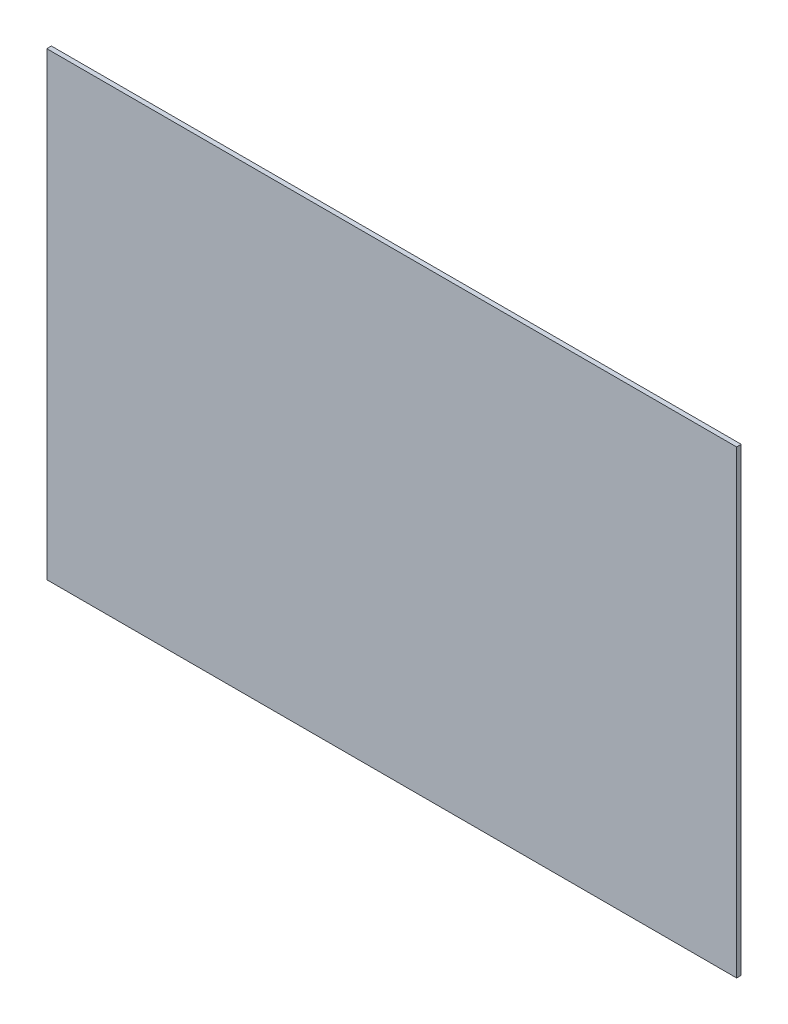
ISO-10303-21;
HEADER;
FILE_DESCRIPTION(('STEP AP214'),'2;1');
FILE_NAME('part.step','',(''),(''),'','','');
FILE_SCHEMA(('AUTOMOTIVE_DESIGN { 1 0 10303 214 1 1 1 1 }'));
ENDSEC;
DATA;
#1=APPLICATION_CONTEXT('core data for automotive mechanical design processes');
#2=APPLICATION_PROTOCOL_DEFINITION('international standard','automotive_design',2000,#1);
#3=PRODUCT_CONTEXT('',#1,'mechanical');
#4=PRODUCT('Part','Part','',(#3));
#5=PRODUCT_RELATED_PRODUCT_CATEGORY('part','',(#4));
#6=PRODUCT_DEFINITION_FORMATION('','',#4);
#7=PRODUCT_DEFINITION_CONTEXT('part definition',#1,'design');
#8=PRODUCT_DEFINITION('design','',#6,#7);
#9=PRODUCT_DEFINITION_SHAPE('','',#8);
#10=(LENGTH_UNIT() NAMED_UNIT(*) SI_UNIT(.MILLI.,.METRE.));
#11=(NAMED_UNIT(*) PLANE_ANGLE_UNIT() SI_UNIT($,.RADIAN.));
#12=(NAMED_UNIT(*) SI_UNIT($,.STERADIAN.) SOLID_ANGLE_UNIT());
#13=UNCERTAINTY_MEASURE_WITH_UNIT(LENGTH_MEASURE(1.E-05),#10,'distance_accuracy_value','');
#14=(GEOMETRIC_REPRESENTATION_CONTEXT(3) GLOBAL_UNCERTAINTY_ASSIGNED_CONTEXT((#13)) GLOBAL_UNIT_ASSIGNED_CONTEXT((#10,
#11,#12)) REPRESENTATION_CONTEXT('',''));
#15=CARTESIAN_POINT('',(0.,0.,0.));
#16=DIRECTION('',(0.,0.,1.));
#17=DIRECTION('',(1.,0.,0.));
#18=AXIS2_PLACEMENT_3D('',#15,#16,#17);
#19=CARTESIAN_POINT('',(-150.000000000006,99.9999999999985,2.00000000000589));
#20=DIRECTION('',(1.00000000000002,0.,0.));
#21=DIRECTION('',(0.,1.,0.));
#22=AXIS2_PLACEMENT_3D('',#19,#20,#21);
#23=PLANE('',#22);
#24=DIRECTION('',(0.,-1.,0.));
#25=VECTOR('',#24,1.);
#26=CARTESIAN_POINT('',(-150.000000000006,99.9999999999985,5.88418203051333E-12));
#27=LINE('',#26,#25);
#28=CARTESIAN_POINT('',(-150.000000000006,99.9999999999985,5.88418203051333E-12));
#29=VERTEX_POINT('',#28);
#30=CARTESIAN_POINT('',(-150.000000000006,-100.000000000001,5.88418203051333E-12));
#31=VERTEX_POINT('',#30);
#32=EDGE_CURVE('E97',#29,#31,#27,.T.);
#33=ORIENTED_EDGE('',*,*,#32,.T.);
#34=DIRECTION('',(0.,0.,-1.));
#35=VECTOR('',#34,1.);
#36=CARTESIAN_POINT('',(-150.000000000006,-100.000000000001,2.00000000000589));
#37=LINE('',#36,#35);
#38=CARTESIAN_POINT('',(-150.000000000006,-100.000000000001,2.00000000000589));
#39=VERTEX_POINT('',#38);
#40=EDGE_CURVE('E11',#39,#31,#37,.T.);
#41=ORIENTED_EDGE('',*,*,#40,.F.);
#42=DIRECTION('',(0.,-1.,0.));
#43=VECTOR('',#42,1.);
#44=CARTESIAN_POINT('',(-150.000000000006,99.9999999999985,2.00000000000589));
#45=LINE('',#44,#43);
#46=CARTESIAN_POINT('',(-150.000000000006,99.9999999999985,2.00000000000589));
#47=VERTEX_POINT('',#46);
#48=EDGE_CURVE('E85',#47,#39,#45,.T.);
#49=ORIENTED_EDGE('',*,*,#48,.F.);
#50=DIRECTION('',(0.,0.,-1.));
#51=VECTOR('',#50,1.);
#52=CARTESIAN_POINT('',(-150.000000000006,99.9999999999985,2.00000000000589));
#53=LINE('',#52,#51);
#54=EDGE_CURVE('E93',#47,#29,#53,.T.);
#55=ORIENTED_EDGE('',*,*,#54,.T.);
#56=EDGE_LOOP('',(#33,#41,#49,#55));
#57=FACE_BOUND('',#56,.T.);
#58=ADVANCED_FACE('F34',(#57),#23,.F.);
#59=CARTESIAN_POINT('',(150.000000000003,-100.,2.));
#60=DIRECTION('',(0.,1.,0.));
#61=DIRECTION('',(0.,0.,1.));
#62=AXIS2_PLACEMENT_3D('',#59,#60,#61);
#63=PLANE('',#62);
#64=DIRECTION('',(1.00000000000002,0.,0.));
#65=VECTOR('',#64,1.);
#66=CARTESIAN_POINT('',(150.000000000003,-100.,0.));
#67=LINE('',#66,#65);
#68=CARTESIAN_POINT('',(150.000000000003,-100.,0.));
#69=VERTEX_POINT('',#68);
#70=EDGE_CURVE('E89',#31,#69,#67,.T.);
#71=ORIENTED_EDGE('',*,*,#70,.T.);
#72=DIRECTION('',(0.,0.,-1.));
#73=VECTOR('',#72,1.);
#74=CARTESIAN_POINT('',(150.000000000003,-100.,2.));
#75=LINE('',#74,#73);
#76=CARTESIAN_POINT('',(150.000000000003,-100.,2.));
#77=VERTEX_POINT('',#76);
#78=EDGE_CURVE('E42',#77,#69,#75,.T.);
#79=ORIENTED_EDGE('',*,*,#78,.F.);
#80=DIRECTION('',(1.00000000000002,0.,0.));
#81=VECTOR('',#80,1.);
#82=CARTESIAN_POINT('',(150.000000000003,-100.,2.));
#83=LINE('',#82,#81);
#84=EDGE_CURVE('E80',#39,#77,#83,.T.);
#85=ORIENTED_EDGE('',*,*,#84,.F.);
#86=ORIENTED_EDGE('',*,*,#40,.T.);
#87=EDGE_LOOP('',(#71,#79,#85,#86));
#88=FACE_BOUND('',#87,.T.);
#89=ADVANCED_FACE('F88',(#88),#63,.F.);
#90=CARTESIAN_POINT('',(150.,100.,2.));
#91=DIRECTION('',(-1.00000000000002,0.,0.));
#92=DIRECTION('',(0.,0.,1.));
#93=AXIS2_PLACEMENT_3D('',#90,#91,#92);
#94=PLANE('',#93);
#95=DIRECTION('',(0.,1.,0.));
#96=VECTOR('',#95,1.);
#97=CARTESIAN_POINT('',(150.000000000002,100.,0.));
#98=LINE('',#97,#96);
#99=CARTESIAN_POINT('',(150.000000000002,100.,0.));
#100=VERTEX_POINT('',#99);
#101=EDGE_CURVE('E67',#69,#100,#98,.T.);
#102=ORIENTED_EDGE('',*,*,#101,.T.);
#103=DIRECTION('',(0.,0.,-1.));
#104=VECTOR('',#103,1.);
#105=CARTESIAN_POINT('',(150.,100.,2.));
#106=LINE('',#105,#104);
#107=CARTESIAN_POINT('',(150.,100.,2.));
#108=VERTEX_POINT('',#107);
#109=EDGE_CURVE('E90',#108,#100,#106,.T.);
#110=ORIENTED_EDGE('',*,*,#109,.F.);
#111=DIRECTION('',(0.,1.,0.));
#112=VECTOR('',#111,1.);
#113=CARTESIAN_POINT('',(150.,100.,2.));
#114=LINE('',#113,#112);
#115=EDGE_CURVE('E83',#77,#108,#114,.T.);
#116=ORIENTED_EDGE('',*,*,#115,.F.);
#117=ORIENTED_EDGE('',*,*,#78,.T.);
#118=EDGE_LOOP('',(#102,#110,#116,#117));
#119=FACE_BOUND('',#118,.T.);
#120=ADVANCED_FACE('F91',(#119),#94,.F.);
#121=CARTESIAN_POINT('',(150.,100.,2.));
#122=DIRECTION('',(0.,-1.,0.));
#123=DIRECTION('',(1.00000000000002,0.,0.));
#124=AXIS2_PLACEMENT_3D('',#121,#122,#123);
#125=PLANE('',#124);
#126=DIRECTION('',(-1.00000000000002,0.,0.));
#127=VECTOR('',#126,1.);
#128=CARTESIAN_POINT('',(150.000000000002,100.,0.));
#129=LINE('',#128,#127);
#130=EDGE_CURVE('E73',#100,#29,#129,.T.);
#131=ORIENTED_EDGE('',*,*,#130,.T.);
#132=ORIENTED_EDGE('',*,*,#54,.F.);
#133=DIRECTION('',(-1.00000000000002,0.,0.));
#134=VECTOR('',#133,1.);
#135=CARTESIAN_POINT('',(150.,100.,2.));
#136=LINE('',#135,#134);
#137=EDGE_CURVE('E50',#108,#47,#136,.T.);
#138=ORIENTED_EDGE('',*,*,#137,.F.);
#139=ORIENTED_EDGE('',*,*,#109,.T.);
#140=EDGE_LOOP('',(#131,#132,#138,#139));
#141=FACE_BOUND('',#140,.T.);
#142=ADVANCED_FACE('F104',(#141),#125,.F.);
#143=CARTESIAN_POINT('',(0.,0.,2.));
#144=DIRECTION('',(0.,0.,-1.));
#145=DIRECTION('',(-1.00000000000002,0.,0.));
#146=AXIS2_PLACEMENT_3D('',#143,#144,#145);
#147=PLANE('',#146);
#148=ORIENTED_EDGE('',*,*,#48,.T.);
#149=ORIENTED_EDGE('',*,*,#84,.T.);
#150=ORIENTED_EDGE('',*,*,#115,.T.);
#151=ORIENTED_EDGE('',*,*,#137,.T.);
#152=EDGE_LOOP('',(#148,#149,#150,#151));
#153=FACE_BOUND('',#152,.T.);
#154=ADVANCED_FACE('F81',(#153),#147,.F.);
#155=CARTESIAN_POINT('',(0.,0.,0.));
#156=DIRECTION('',(0.,0.,-1.));
#157=DIRECTION('',(-1.00000000000002,0.,0.));
#158=AXIS2_PLACEMENT_3D('',#155,#156,#157);
#159=PLANE('',#158);
#160=ORIENTED_EDGE('',*,*,#32,.F.);
#161=ORIENTED_EDGE('',*,*,#130,.F.);
#162=ORIENTED_EDGE('',*,*,#101,.F.);
#163=ORIENTED_EDGE('',*,*,#70,.F.);
#164=EDGE_LOOP('',(#160,#161,#162,#163));
#165=FACE_BOUND('',#164,.T.);
#166=ADVANCED_FACE('F107',(#165),#159,.T.);
#167=CLOSED_SHELL('',(#58,#89,#120,#142,#154,#166));
#168=MANIFOLD_SOLID_BREP('B2',#167);
#169=ADVANCED_BREP_SHAPE_REPRESENTATION('',(#18,#168),#14);
#170=SHAPE_DEFINITION_REPRESENTATION(#9,#169);
ENDSEC;
END-ISO-10303-21;
